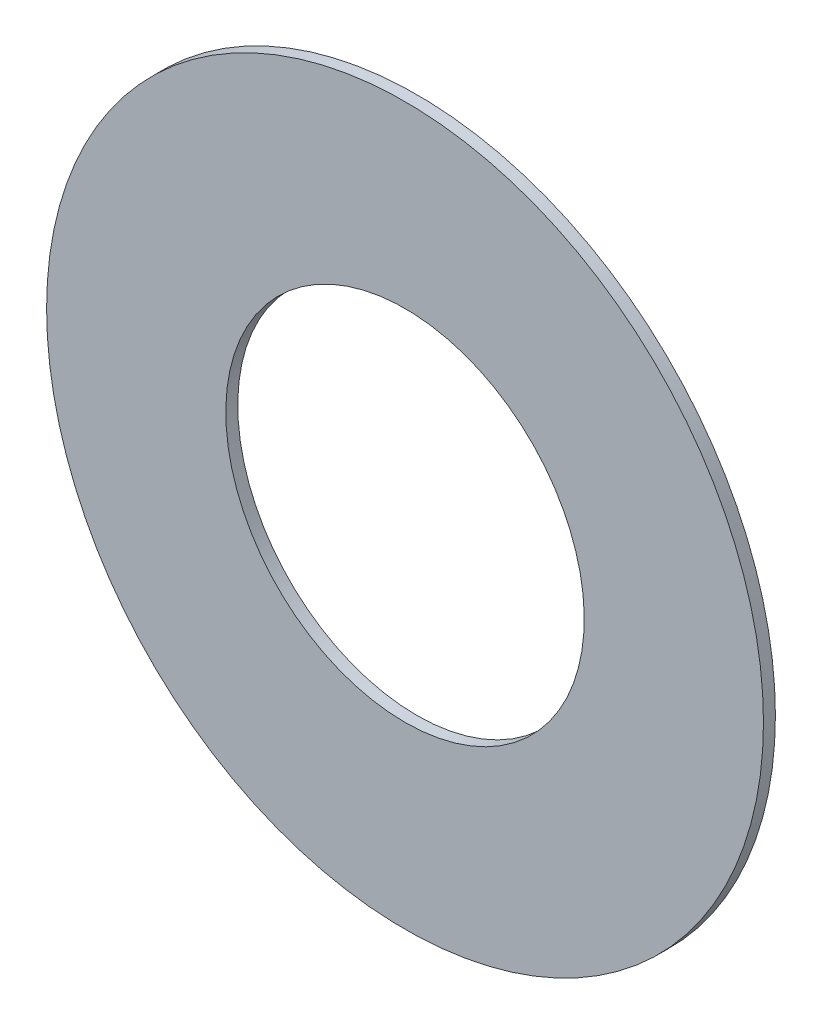
ISO-10303-21;
HEADER;
FILE_DESCRIPTION(('STEP AP214'),'2;1');
FILE_NAME('part.step','',(''),(''),'','','');
FILE_SCHEMA(('AUTOMOTIVE_DESIGN { 1 0 10303 214 1 1 1 1 }'));
ENDSEC;
DATA;
#1=APPLICATION_CONTEXT('core data for automotive mechanical design processes');
#2=APPLICATION_PROTOCOL_DEFINITION('international standard','automotive_design',2000,#1);
#3=PRODUCT_CONTEXT('',#1,'mechanical');
#4=PRODUCT('Part','Part','',(#3));
#5=PRODUCT_RELATED_PRODUCT_CATEGORY('part','',(#4));
#6=PRODUCT_DEFINITION_FORMATION('','',#4);
#7=PRODUCT_DEFINITION_CONTEXT('part definition',#1,'design');
#8=PRODUCT_DEFINITION('design','',#6,#7);
#9=PRODUCT_DEFINITION_SHAPE('','',#8);
#10=(LENGTH_UNIT() NAMED_UNIT(*) SI_UNIT(.MILLI.,.METRE.));
#11=(NAMED_UNIT(*) PLANE_ANGLE_UNIT() SI_UNIT($,.RADIAN.));
#12=(NAMED_UNIT(*) SI_UNIT($,.STERADIAN.) SOLID_ANGLE_UNIT());
#13=UNCERTAINTY_MEASURE_WITH_UNIT(LENGTH_MEASURE(1.E-05),#10,'distance_accuracy_value','');
#14=(GEOMETRIC_REPRESENTATION_CONTEXT(3) GLOBAL_UNCERTAINTY_ASSIGNED_CONTEXT((#13)) GLOBAL_UNIT_ASSIGNED_CONTEXT((#10,
#11,#12)) REPRESENTATION_CONTEXT('',''));
#15=CARTESIAN_POINT('',(0.,0.,0.));
#16=DIRECTION('',(0.,0.,1.));
#17=DIRECTION('',(1.,0.,0.));
#18=AXIS2_PLACEMENT_3D('',#15,#16,#17);
#19=CARTESIAN_POINT('',(139.452,-111.734,-0.045));
#20=DIRECTION('',(0.,0.,-1.));
#21=DIRECTION('',(0.,-1.,0.));
#22=AXIS2_PLACEMENT_3D('',#19,#20,#21);
#23=CYLINDRICAL_SURFACE('',#22,0.525);
#24=CARTESIAN_POINT('',(139.452,-111.734,-0.035));
#25=DIRECTION('',(0.,0.,-1.));
#26=DIRECTION('',(0.,-1.,0.));
#27=AXIS2_PLACEMENT_3D('',#24,#25,#26);
#28=CIRCLE('',#27,0.525);
#29=CARTESIAN_POINT('',(139.452,-112.259,-0.035));
#30=VERTEX_POINT('',#29);
#31=EDGE_CURVE('E25',#30,#30,#28,.T.);
#32=ORIENTED_EDGE('',*,*,#31,.T.);
#33=DIRECTION('',(0.,0.,1.));
#34=VECTOR('',#33,1.);
#35=CARTESIAN_POINT('',(139.452,-112.259,-0.045));
#36=LINE('',#35,#34);
#37=CARTESIAN_POINT('',(139.452,-112.259,0.));
#38=VERTEX_POINT('',#37);
#39=EDGE_CURVE('E11',#30,#38,#36,.T.);
#40=ORIENTED_EDGE('',*,*,#39,.T.);
#41=CARTESIAN_POINT('',(139.452,-111.734,0.));
#42=DIRECTION('',(0.,0.,-1.));
#43=DIRECTION('',(0.,-1.,0.));
#44=AXIS2_PLACEMENT_3D('',#41,#42,#43);
#45=CIRCLE('',#44,0.525);
#46=EDGE_CURVE('E67',#38,#38,#45,.T.);
#47=ORIENTED_EDGE('',*,*,#46,.F.);
#48=ORIENTED_EDGE('',*,*,#39,.F.);
#49=EDGE_LOOP('',(#32,#40,#47,#48));
#50=FACE_BOUND('',#49,.T.);
#51=ADVANCED_FACE('F17',(#50),#23,.F.);
#52=CARTESIAN_POINT('',(139.452,-111.734,-0.035));
#53=DIRECTION('',(0.,0.,1.));
#54=DIRECTION('',(1.,0.,0.));
#55=AXIS2_PLACEMENT_3D('',#52,#53,#54);
#56=PLANE('',#55);
#57=ORIENTED_EDGE('',*,*,#31,.F.);
#58=EDGE_LOOP('',(#57));
#59=FACE_BOUND('',#58,.T.);
#60=CARTESIAN_POINT('',(139.452,-111.734,-0.035));
#61=DIRECTION('',(0.,0.,1.));
#62=DIRECTION('',(1.,0.,0.));
#63=AXIS2_PLACEMENT_3D('',#60,#61,#62);
#64=CIRCLE('',#63,1.05);
#65=CARTESIAN_POINT('',(140.502,-111.734,-0.035));
#66=VERTEX_POINT('',#65);
#67=EDGE_CURVE('E56',#66,#66,#64,.T.);
#68=ORIENTED_EDGE('',*,*,#67,.F.);
#69=EDGE_LOOP('',(#68));
#70=FACE_BOUND('',#69,.T.);
#71=ADVANCED_FACE('F76',(#59,#70),#56,.F.);
#72=CARTESIAN_POINT('',(139.452,-111.734,0.));
#73=DIRECTION('',(0.,0.,1.));
#74=DIRECTION('',(1.,0.,0.));
#75=AXIS2_PLACEMENT_3D('',#72,#73,#74);
#76=PLANE('',#75);
#77=ORIENTED_EDGE('',*,*,#46,.T.);
#78=EDGE_LOOP('',(#77));
#79=FACE_BOUND('',#78,.T.);
#80=CARTESIAN_POINT('',(139.452,-111.734,0.));
#81=DIRECTION('',(0.,0.,1.));
#82=DIRECTION('',(1.,0.,0.));
#83=AXIS2_PLACEMENT_3D('',#80,#81,#82);
#84=CIRCLE('',#83,1.05);
#85=CARTESIAN_POINT('',(140.502,-111.734,0.));
#86=VERTEX_POINT('',#85);
#87=EDGE_CURVE('E54',#86,#86,#84,.T.);
#88=ORIENTED_EDGE('',*,*,#87,.T.);
#89=EDGE_LOOP('',(#88));
#90=FACE_BOUND('',#89,.T.);
#91=ADVANCED_FACE('F60',(#79,#90),#76,.T.);
#92=CARTESIAN_POINT('',(139.452,-111.734,-0.035));
#93=DIRECTION('',(0.,0.,1.));
#94=DIRECTION('',(1.,0.,0.));
#95=AXIS2_PLACEMENT_3D('',#92,#93,#94);
#96=CYLINDRICAL_SURFACE('',#95,1.05);
#97=ORIENTED_EDGE('',*,*,#87,.F.);
#98=DIRECTION('',(0.,0.,1.));
#99=VECTOR('',#98,1.);
#100=CARTESIAN_POINT('',(140.502,-111.734,-0.035));
#101=LINE('',#100,#99);
#102=EDGE_CURVE('E51',#66,#86,#101,.T.);
#103=ORIENTED_EDGE('',*,*,#102,.F.);
#104=ORIENTED_EDGE('',*,*,#67,.T.);
#105=ORIENTED_EDGE('',*,*,#102,.T.);
#106=EDGE_LOOP('',(#97,#103,#104,#105));
#107=FACE_BOUND('',#106,.T.);
#108=ADVANCED_FACE('F53',(#107),#96,.T.);
#109=CLOSED_SHELL('',(#51,#71,#91,#108));
#110=MANIFOLD_SOLID_BREP('B1',#109);
#111=ADVANCED_BREP_SHAPE_REPRESENTATION('',(#18,#110),#14);
#112=SHAPE_DEFINITION_REPRESENTATION(#9,#111);
ENDSEC;
END-ISO-10303-21;
